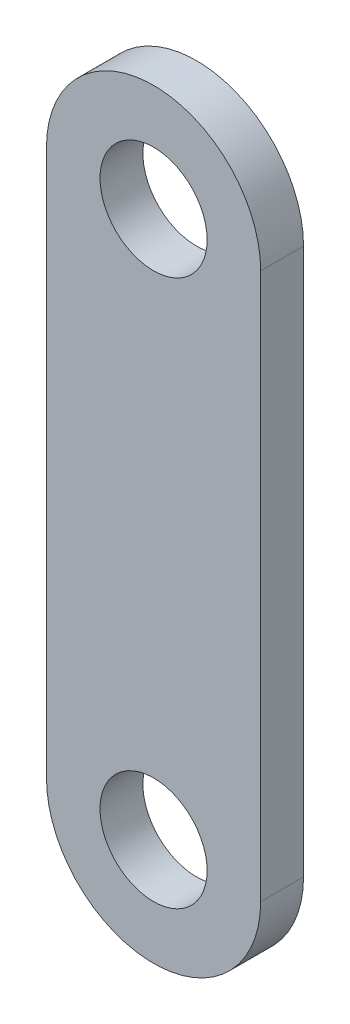
ISO-10303-21;
HEADER;
FILE_DESCRIPTION(('STEP AP214'),'2;1');
FILE_NAME('part.step','',(''),(''),'','','');
FILE_SCHEMA(('AUTOMOTIVE_DESIGN { 1 0 10303 214 1 1 1 1 }'));
ENDSEC;
DATA;
#1=APPLICATION_CONTEXT('core data for automotive mechanical design processes');
#2=APPLICATION_PROTOCOL_DEFINITION('international standard','automotive_design',2000,#1);
#3=PRODUCT_CONTEXT('',#1,'mechanical');
#4=PRODUCT('Part','Part','',(#3));
#5=PRODUCT_RELATED_PRODUCT_CATEGORY('part','',(#4));
#6=PRODUCT_DEFINITION_FORMATION('','',#4);
#7=PRODUCT_DEFINITION_CONTEXT('part definition',#1,'design');
#8=PRODUCT_DEFINITION('design','',#6,#7);
#9=PRODUCT_DEFINITION_SHAPE('','',#8);
#10=(LENGTH_UNIT() NAMED_UNIT(*) SI_UNIT(.MILLI.,.METRE.));
#11=(NAMED_UNIT(*) PLANE_ANGLE_UNIT() SI_UNIT($,.RADIAN.));
#12=(NAMED_UNIT(*) SI_UNIT($,.STERADIAN.) SOLID_ANGLE_UNIT());
#13=UNCERTAINTY_MEASURE_WITH_UNIT(LENGTH_MEASURE(1.E-05),#10,'distance_accuracy_value','');
#14=(GEOMETRIC_REPRESENTATION_CONTEXT(3) GLOBAL_UNCERTAINTY_ASSIGNED_CONTEXT((#13)) GLOBAL_UNIT_ASSIGNED_CONTEXT((#10,
#11,#12)) REPRESENTATION_CONTEXT('',''));
#15=CARTESIAN_POINT('',(0.,0.,0.));
#16=DIRECTION('',(0.,0.,1.));
#17=DIRECTION('',(1.,0.,0.));
#18=AXIS2_PLACEMENT_3D('',#15,#16,#17);
#19=CARTESIAN_POINT('',(0.,127.5,20.));
#20=DIRECTION('',(0.,0.,-1.));
#21=DIRECTION('',(-1.,0.,0.));
#22=AXIS2_PLACEMENT_3D('',#19,#20,#21);
#23=CYLINDRICAL_SURFACE('',#22,50.);
#24=CARTESIAN_POINT('',(0.,127.5,0.));
#25=DIRECTION('',(0.,0.,1.));
#26=DIRECTION('',(-1.,0.,0.));
#27=AXIS2_PLACEMENT_3D('',#24,#25,#26);
#28=CIRCLE('',#27,50.);
#29=CARTESIAN_POINT('',(50.,127.5,0.));
#30=VERTEX_POINT('',#29);
#31=CARTESIAN_POINT('',(-50.,127.5,0.));
#32=VERTEX_POINT('',#31);
#33=EDGE_CURVE('E96',#30,#32,#28,.T.);
#34=ORIENTED_EDGE('',*,*,#33,.T.);
#35=DIRECTION('',(0.,0.,-1.));
#36=VECTOR('',#35,1.);
#37=CARTESIAN_POINT('',(-50.,127.5,20.));
#38=LINE('',#37,#36);
#39=CARTESIAN_POINT('',(-50.,127.5,20.));
#40=VERTEX_POINT('',#39);
#41=EDGE_CURVE('E11',#40,#32,#38,.T.);
#42=ORIENTED_EDGE('',*,*,#41,.F.);
#43=CARTESIAN_POINT('',(0.,127.5,20.));
#44=DIRECTION('',(0.,0.,1.));
#45=DIRECTION('',(-1.,0.,0.));
#46=AXIS2_PLACEMENT_3D('',#43,#44,#45);
#47=CIRCLE('',#46,50.);
#48=CARTESIAN_POINT('',(50.,127.5,20.));
#49=VERTEX_POINT('',#48);
#50=EDGE_CURVE('E84',#49,#40,#47,.T.);
#51=ORIENTED_EDGE('',*,*,#50,.F.);
#52=DIRECTION('',(0.,0.,-1.));
#53=VECTOR('',#52,1.);
#54=CARTESIAN_POINT('',(50.,127.5,20.));
#55=LINE('',#54,#53);
#56=EDGE_CURVE('E92',#49,#30,#55,.T.);
#57=ORIENTED_EDGE('',*,*,#56,.T.);
#58=EDGE_LOOP('',(#34,#42,#51,#57));
#59=FACE_BOUND('',#58,.T.);
#60=ADVANCED_FACE('F33',(#59),#23,.T.);
#61=CARTESIAN_POINT('',(-50.,-127.5,20.));
#62=DIRECTION('',(1.,0.,0.));
#63=DIRECTION('',(0.,0.,-1.));
#64=AXIS2_PLACEMENT_3D('',#61,#62,#63);
#65=PLANE('',#64);
#66=DIRECTION('',(0.,-1.,0.));
#67=VECTOR('',#66,1.);
#68=CARTESIAN_POINT('',(-50.,-127.5,0.));
#69=LINE('',#68,#67);
#70=CARTESIAN_POINT('',(-50.,-127.5,0.));
#71=VERTEX_POINT('',#70);
#72=EDGE_CURVE('E88',#32,#71,#69,.T.);
#73=ORIENTED_EDGE('',*,*,#72,.T.);
#74=DIRECTION('',(0.,0.,-1.));
#75=VECTOR('',#74,1.);
#76=CARTESIAN_POINT('',(-50.,-127.5,20.));
#77=LINE('',#76,#75);
#78=CARTESIAN_POINT('',(-50.,-127.5,20.));
#79=VERTEX_POINT('',#78);
#80=EDGE_CURVE('E41',#79,#71,#77,.T.);
#81=ORIENTED_EDGE('',*,*,#80,.F.);
#82=DIRECTION('',(0.,-1.,0.));
#83=VECTOR('',#82,1.);
#84=CARTESIAN_POINT('',(-50.,-127.5,20.));
#85=LINE('',#84,#83);
#86=EDGE_CURVE('E79',#40,#79,#85,.T.);
#87=ORIENTED_EDGE('',*,*,#86,.F.);
#88=ORIENTED_EDGE('',*,*,#41,.T.);
#89=EDGE_LOOP('',(#73,#81,#87,#88));
#90=FACE_BOUND('',#89,.T.);
#91=ADVANCED_FACE('F87',(#90),#65,.F.);
#92=CARTESIAN_POINT('',(0.,-127.5,20.));
#93=DIRECTION('',(0.,0.,-1.));
#94=DIRECTION('',(-1.,0.,0.));
#95=AXIS2_PLACEMENT_3D('',#92,#93,#94);
#96=CYLINDRICAL_SURFACE('',#95,50.);
#97=CARTESIAN_POINT('',(0.,-127.5,0.));
#98=DIRECTION('',(0.,0.,1.));
#99=DIRECTION('',(1.,0.,0.));
#100=AXIS2_PLACEMENT_3D('',#97,#98,#99);
#101=CIRCLE('',#100,50.);
#102=CARTESIAN_POINT('',(50.,-127.5,0.));
#103=VERTEX_POINT('',#102);
#104=EDGE_CURVE('E66',#71,#103,#101,.T.);
#105=ORIENTED_EDGE('',*,*,#104,.T.);
#106=DIRECTION('',(0.,0.,-1.));
#107=VECTOR('',#106,1.);
#108=CARTESIAN_POINT('',(50.,-127.5,20.));
#109=LINE('',#108,#107);
#110=CARTESIAN_POINT('',(50.,-127.5,20.));
#111=VERTEX_POINT('',#110);
#112=EDGE_CURVE('E89',#111,#103,#109,.T.);
#113=ORIENTED_EDGE('',*,*,#112,.F.);
#114=CARTESIAN_POINT('',(0.,-127.5,20.));
#115=DIRECTION('',(0.,0.,1.));
#116=DIRECTION('',(1.,0.,0.));
#117=AXIS2_PLACEMENT_3D('',#114,#115,#116);
#118=CIRCLE('',#117,50.);
#119=EDGE_CURVE('E82',#79,#111,#118,.T.);
#120=ORIENTED_EDGE('',*,*,#119,.F.);
#121=ORIENTED_EDGE('',*,*,#80,.T.);
#122=EDGE_LOOP('',(#105,#113,#120,#121));
#123=FACE_BOUND('',#122,.T.);
#124=ADVANCED_FACE('F90',(#123),#96,.T.);
#125=CARTESIAN_POINT('',(50.,-127.5,20.));
#126=DIRECTION('',(-1.,0.,0.));
#127=DIRECTION('',(0.,0.,1.));
#128=AXIS2_PLACEMENT_3D('',#125,#126,#127);
#129=PLANE('',#128);
#130=DIRECTION('',(0.,1.,0.));
#131=VECTOR('',#130,1.);
#132=CARTESIAN_POINT('',(50.,-127.5,0.));
#133=LINE('',#132,#131);
#134=EDGE_CURVE('E72',#103,#30,#133,.T.);
#135=ORIENTED_EDGE('',*,*,#134,.T.);
#136=ORIENTED_EDGE('',*,*,#56,.F.);
#137=DIRECTION('',(0.,1.,0.));
#138=VECTOR('',#137,1.);
#139=CARTESIAN_POINT('',(50.,-127.5,20.));
#140=LINE('',#139,#138);
#141=EDGE_CURVE('E49',#111,#49,#140,.T.);
#142=ORIENTED_EDGE('',*,*,#141,.F.);
#143=ORIENTED_EDGE('',*,*,#112,.T.);
#144=EDGE_LOOP('',(#135,#136,#142,#143));
#145=FACE_BOUND('',#144,.T.);
#146=ADVANCED_FACE('F104',(#145),#129,.F.);
#147=CARTESIAN_POINT('',(0.,127.5,20.));
#148=DIRECTION('',(0.,0.,-1.));
#149=DIRECTION('',(-1.,0.,0.));
#150=AXIS2_PLACEMENT_3D('',#147,#148,#149);
#151=PLANE('',#150);
#152=CARTESIAN_POINT('',(0.,127.5,20.));
#153=DIRECTION('',(0.,0.,1.));
#154=DIRECTION('',(1.,0.,0.));
#155=AXIS2_PLACEMENT_3D('',#152,#153,#154);
#156=CIRCLE('',#155,25.);
#157=CARTESIAN_POINT('',(25.,127.5,20.));
#158=VERTEX_POINT('',#157);
#159=EDGE_CURVE('E116',#158,#158,#156,.T.);
#160=ORIENTED_EDGE('',*,*,#159,.F.);
#161=EDGE_LOOP('',(#160));
#162=FACE_BOUND('',#161,.T.);
#163=CARTESIAN_POINT('',(0.,-127.5,20.));
#164=DIRECTION('',(0.,0.,1.));
#165=DIRECTION('',(1.,0.,0.));
#166=AXIS2_PLACEMENT_3D('',#163,#164,#165);
#167=CIRCLE('',#166,25.);
#168=CARTESIAN_POINT('',(25.,-127.5,20.));
#169=VERTEX_POINT('',#168);
#170=EDGE_CURVE('E110',#169,#169,#167,.T.);
#171=ORIENTED_EDGE('',*,*,#170,.F.);
#172=EDGE_LOOP('',(#171));
#173=FACE_BOUND('',#172,.T.);
#174=ORIENTED_EDGE('',*,*,#50,.T.);
#175=ORIENTED_EDGE('',*,*,#86,.T.);
#176=ORIENTED_EDGE('',*,*,#119,.T.);
#177=ORIENTED_EDGE('',*,*,#141,.T.);
#178=EDGE_LOOP('',(#174,#175,#176,#177));
#179=FACE_BOUND('',#178,.T.);
#180=ADVANCED_FACE('F80',(#162,#173,#179),#151,.F.);
#181=CARTESIAN_POINT('',(0.,127.5,0.));
#182=DIRECTION('',(0.,0.,-1.));
#183=DIRECTION('',(-1.,0.,0.));
#184=AXIS2_PLACEMENT_3D('',#181,#182,#183);
#185=PLANE('',#184);
#186=CARTESIAN_POINT('',(0.,127.5,0.));
#187=DIRECTION('',(0.,0.,1.));
#188=DIRECTION('',(1.,0.,0.));
#189=AXIS2_PLACEMENT_3D('',#186,#187,#188);
#190=CIRCLE('',#189,25.);
#191=CARTESIAN_POINT('',(25.,127.5,0.));
#192=VERTEX_POINT('',#191);
#193=EDGE_CURVE('E99',#192,#192,#190,.T.);
#194=ORIENTED_EDGE('',*,*,#193,.T.);
#195=EDGE_LOOP('',(#194));
#196=FACE_BOUND('',#195,.T.);
#197=CARTESIAN_POINT('',(0.,-127.5,0.));
#198=DIRECTION('',(0.,0.,1.));
#199=DIRECTION('',(1.,0.,0.));
#200=AXIS2_PLACEMENT_3D('',#197,#198,#199);
#201=CIRCLE('',#200,25.);
#202=CARTESIAN_POINT('',(25.,-127.5,0.));
#203=VERTEX_POINT('',#202);
#204=EDGE_CURVE('E113',#203,#203,#201,.T.);
#205=ORIENTED_EDGE('',*,*,#204,.T.);
#206=EDGE_LOOP('',(#205));
#207=FACE_BOUND('',#206,.T.);
#208=ORIENTED_EDGE('',*,*,#33,.F.);
#209=ORIENTED_EDGE('',*,*,#134,.F.);
#210=ORIENTED_EDGE('',*,*,#104,.F.);
#211=ORIENTED_EDGE('',*,*,#72,.F.);
#212=EDGE_LOOP('',(#208,#209,#210,#211));
#213=FACE_BOUND('',#212,.T.);
#214=ADVANCED_FACE('F107',(#196,#207,#213),#185,.T.);
#215=CARTESIAN_POINT('',(0.,-127.5,0.));
#216=DIRECTION('',(0.,0.,1.));
#217=DIRECTION('',(1.,0.,0.));
#218=AXIS2_PLACEMENT_3D('',#215,#216,#217);
#219=CYLINDRICAL_SURFACE('',#218,25.);
#220=ORIENTED_EDGE('',*,*,#204,.F.);
#221=EDGE_LOOP('',(#220));
#222=FACE_BOUND('',#221,.T.);
#223=ORIENTED_EDGE('',*,*,#170,.T.);
#224=EDGE_LOOP('',(#223));
#225=FACE_BOUND('',#224,.T.);
#226=ADVANCED_FACE('F127',(#222,#225),#219,.F.);
#227=CARTESIAN_POINT('',(0.,127.5,0.));
#228=DIRECTION('',(0.,0.,1.));
#229=DIRECTION('',(1.,0.,0.));
#230=AXIS2_PLACEMENT_3D('',#227,#228,#229);
#231=CYLINDRICAL_SURFACE('',#230,25.);
#232=ORIENTED_EDGE('',*,*,#193,.F.);
#233=EDGE_LOOP('',(#232));
#234=FACE_BOUND('',#233,.T.);
#235=ORIENTED_EDGE('',*,*,#159,.T.);
#236=EDGE_LOOP('',(#235));
#237=FACE_BOUND('',#236,.T.);
#238=ADVANCED_FACE('F124',(#234,#237),#231,.F.);
#239=CLOSED_SHELL('',(#60,#91,#124,#146,#180,#214,#226,#238));
#240=MANIFOLD_SOLID_BREP('B2',#239);
#241=ADVANCED_BREP_SHAPE_REPRESENTATION('',(#18,#240),#14);
#242=SHAPE_DEFINITION_REPRESENTATION(#9,#241);
ENDSEC;
END-ISO-10303-21;
